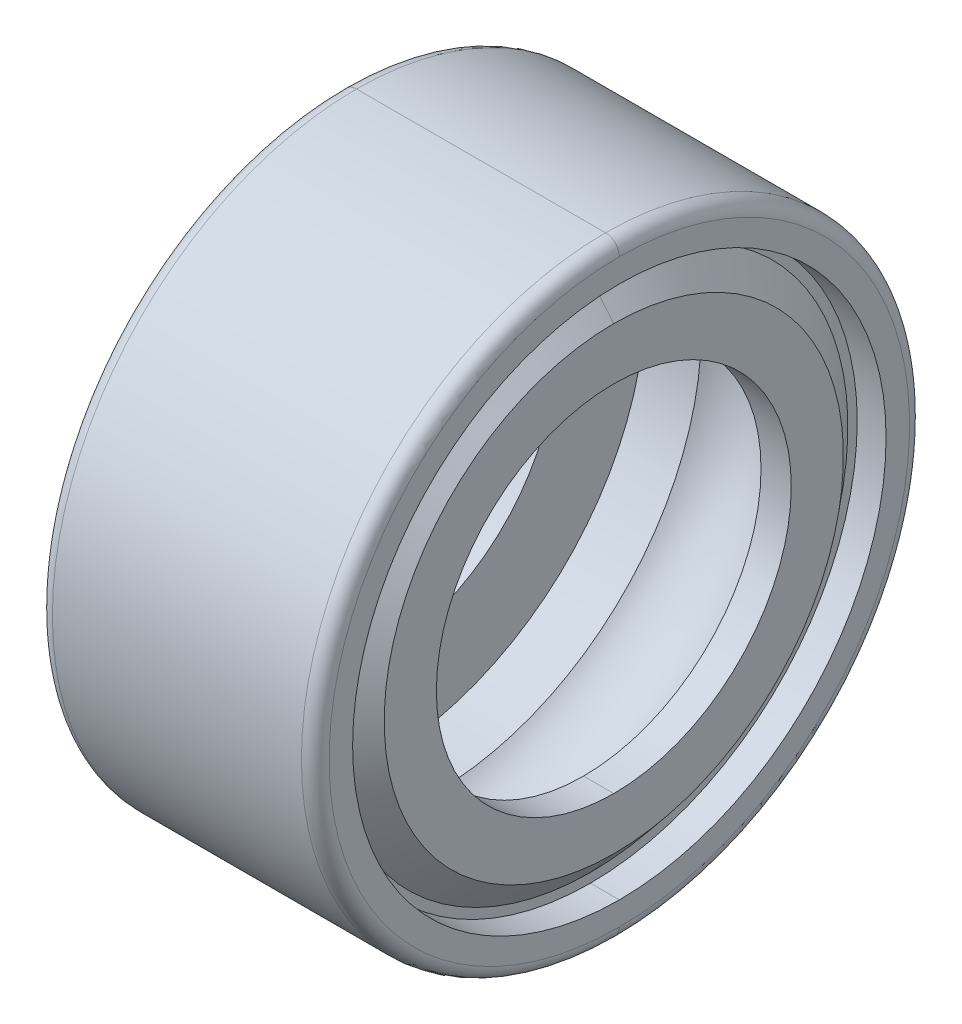
ISO-10303-21;
HEADER;
FILE_DESCRIPTION(('STEP AP214'),'2;1');
FILE_NAME('part.step','',(''),(''),'','','');
FILE_SCHEMA(('AUTOMOTIVE_DESIGN { 1 0 10303 214 1 1 1 1 }'));
ENDSEC;
DATA;
#1=APPLICATION_CONTEXT('core data for automotive mechanical design processes');
#2=APPLICATION_PROTOCOL_DEFINITION('international standard','automotive_design',2000,#1);
#3=PRODUCT_CONTEXT('',#1,'mechanical');
#4=PRODUCT('Part','Part','',(#3));
#5=PRODUCT_RELATED_PRODUCT_CATEGORY('part','',(#4));
#6=PRODUCT_DEFINITION_FORMATION('','',#4);
#7=PRODUCT_DEFINITION_CONTEXT('part definition',#1,'design');
#8=PRODUCT_DEFINITION('design','',#6,#7);
#9=PRODUCT_DEFINITION_SHAPE('','',#8);
#10=(LENGTH_UNIT() NAMED_UNIT(*) SI_UNIT(.MILLI.,.METRE.));
#11=(NAMED_UNIT(*) PLANE_ANGLE_UNIT() SI_UNIT($,.RADIAN.));
#12=(NAMED_UNIT(*) SI_UNIT($,.STERADIAN.) SOLID_ANGLE_UNIT());
#13=UNCERTAINTY_MEASURE_WITH_UNIT(LENGTH_MEASURE(1.E-05),#10,'distance_accuracy_value','');
#14=(GEOMETRIC_REPRESENTATION_CONTEXT(3) GLOBAL_UNCERTAINTY_ASSIGNED_CONTEXT((#13)) GLOBAL_UNIT_ASSIGNED_CONTEXT((#10,
#11,#12)) REPRESENTATION_CONTEXT('',''));
#15=CARTESIAN_POINT('',(0.,0.,0.));
#16=DIRECTION('',(0.,0.,1.));
#17=DIRECTION('',(1.,0.,0.));
#18=AXIS2_PLACEMENT_3D('',#15,#16,#17);
#19=CARTESIAN_POINT('',(-1.97999333714655,0.,0.));
#20=DIRECTION('',(1.,0.,0.));
#21=DIRECTION('',(0.,1.,0.));
#22=AXIS2_PLACEMENT_3D('',#19,#20,#21);
#23=PLANE('',#22);
#24=CARTESIAN_POINT('',(-1.97999333714655,0.,0.));
#25=DIRECTION('',(-1.,0.,0.));
#26=DIRECTION('',(0.,1.,0.));
#27=AXIS2_PLACEMENT_3D('',#24,#25,#26);
#28=CIRCLE('',#27,4.6547982215);
#29=CARTESIAN_POINT('',(-1.97999333714655,4.6547982215,0.));
#30=VERTEX_POINT('',#29);
#31=CARTESIAN_POINT('',(-1.97999333714655,-4.6547982215,0.));
#32=VERTEX_POINT('',#31);
#33=EDGE_CURVE('E304',#30,#32,#28,.T.);
#34=ORIENTED_EDGE('',*,*,#33,.F.);
#35=CARTESIAN_POINT('',(-1.97999333714655,0.,0.));
#36=DIRECTION('',(1.,0.,0.));
#37=DIRECTION('',(0.,1.,0.));
#38=AXIS2_PLACEMENT_3D('',#35,#36,#37);
#39=CIRCLE('',#38,4.6547982215);
#40=EDGE_CURVE('E338',#30,#32,#39,.T.);
#41=ORIENTED_EDGE('',*,*,#40,.T.);
#42=EDGE_LOOP('',(#34,#41));
#43=FACE_BOUND('',#42,.T.);
#44=CARTESIAN_POINT('',(-1.97999333714655,0.,0.));
#45=DIRECTION('',(1.,0.,0.));
#46=DIRECTION('',(0.,-1.,0.));
#47=AXIS2_PLACEMENT_3D('',#44,#45,#46);
#48=CIRCLE('',#47,4.8236251);
#49=CARTESIAN_POINT('',(-1.97999333714655,-4.8236251,0.));
#50=VERTEX_POINT('',#49);
#51=CARTESIAN_POINT('',(-1.97999333714655,4.8236251,0.));
#52=VERTEX_POINT('',#51);
#53=EDGE_CURVE('E27',#50,#52,#48,.T.);
#54=ORIENTED_EDGE('',*,*,#53,.F.);
#55=CARTESIAN_POINT('',(-1.97999333714655,0.,0.));
#56=DIRECTION('',(1.,0.,0.));
#57=DIRECTION('',(0.,1.,0.));
#58=AXIS2_PLACEMENT_3D('',#55,#56,#57);
#59=CIRCLE('',#58,4.8236251);
#60=EDGE_CURVE('E11',#52,#50,#59,.T.);
#61=ORIENTED_EDGE('',*,*,#60,.F.);
#62=EDGE_LOOP('',(#54,#61));
#63=FACE_BOUND('',#62,.T.);
#64=ADVANCED_FACE('F16',(#43,#63),#23,.F.);
#65=CARTESIAN_POINT('',(-2.75209,0.,0.));
#66=DIRECTION('',(1.,0.,0.));
#67=DIRECTION('',(0.,-1.,0.));
#68=AXIS2_PLACEMENT_3D('',#65,#66,#67);
#69=CYLINDRICAL_SURFACE('',#68,4.8236251);
#70=DIRECTION('',(1.,0.,0.));
#71=VECTOR('',#70,1.);
#72=CARTESIAN_POINT('',(-2.5019,-4.8236251,0.));
#73=LINE('',#72,#71);
#74=CARTESIAN_POINT('',(-2.5019,-4.8236251,0.));
#75=VERTEX_POINT('',#74);
#76=EDGE_CURVE('E333',#75,#50,#73,.T.);
#77=ORIENTED_EDGE('',*,*,#76,.F.);
#78=CARTESIAN_POINT('',(-2.5019,0.,0.));
#79=DIRECTION('',(1.,0.,0.));
#80=DIRECTION('',(0.,1.,0.));
#81=AXIS2_PLACEMENT_3D('',#78,#79,#80);
#82=CIRCLE('',#81,4.8236251);
#83=CARTESIAN_POINT('',(-2.5019,4.8236251,0.));
#84=VERTEX_POINT('',#83);
#85=EDGE_CURVE('E334',#84,#75,#82,.T.);
#86=ORIENTED_EDGE('',*,*,#85,.F.);
#87=DIRECTION('',(1.,0.,0.));
#88=VECTOR('',#87,1.);
#89=CARTESIAN_POINT('',(-2.5019,4.8236251,0.));
#90=LINE('',#89,#88);
#91=EDGE_CURVE('E330',#84,#52,#90,.T.);
#92=ORIENTED_EDGE('',*,*,#91,.T.);
#93=ORIENTED_EDGE('',*,*,#60,.T.);
#94=EDGE_LOOP('',(#77,#86,#92,#93));
#95=FACE_BOUND('',#94,.T.);
#96=ADVANCED_FACE('F493',(#95),#69,.F.);
#97=CARTESIAN_POINT('',(-2.75209,0.,0.));
#98=DIRECTION('',(1.,0.,0.));
#99=DIRECTION('',(0.,-1.,0.));
#100=AXIS2_PLACEMENT_3D('',#97,#98,#99);
#101=CYLINDRICAL_SURFACE('',#100,4.8236251);
#102=ORIENTED_EDGE('',*,*,#91,.F.);
#103=CARTESIAN_POINT('',(-2.5019,0.,0.));
#104=DIRECTION('',(-1.,0.,0.));
#105=DIRECTION('',(0.,1.,0.));
#106=AXIS2_PLACEMENT_3D('',#103,#104,#105);
#107=CIRCLE('',#106,4.8236251);
#108=EDGE_CURVE('E367',#84,#75,#107,.T.);
#109=ORIENTED_EDGE('',*,*,#108,.T.);
#110=ORIENTED_EDGE('',*,*,#76,.T.);
#111=ORIENTED_EDGE('',*,*,#53,.T.);
#112=EDGE_LOOP('',(#102,#109,#110,#111));
#113=FACE_BOUND('',#112,.T.);
#114=ADVANCED_FACE('F499',(#113),#101,.F.);
#115=CARTESIAN_POINT('',(-2.5019,0.,0.));
#116=DIRECTION('',(1.,0.,0.));
#117=DIRECTION('',(0.,1.,0.));
#118=AXIS2_PLACEMENT_3D('',#115,#116,#117);
#119=PLANE('',#118);
#120=ORIENTED_EDGE('',*,*,#108,.F.);
#121=ORIENTED_EDGE('',*,*,#85,.T.);
#122=EDGE_LOOP('',(#120,#121));
#123=FACE_BOUND('',#122,.T.);
#124=CARTESIAN_POINT('',(-2.5019,0.,0.));
#125=DIRECTION('',(1.,0.,0.));
#126=DIRECTION('',(0.,1.,0.));
#127=AXIS2_PLACEMENT_3D('',#124,#125,#126);
#128=CIRCLE('',#127,5.24891);
#129=CARTESIAN_POINT('',(-2.5019,5.24891,0.));
#130=VERTEX_POINT('',#129);
#131=CARTESIAN_POINT('',(-2.5019,-5.24891,0.));
#132=VERTEX_POINT('',#131);
#133=EDGE_CURVE('E291',#130,#132,#128,.T.);
#134=ORIENTED_EDGE('',*,*,#133,.F.);
#135=CARTESIAN_POINT('',(-2.5019,0.,0.));
#136=DIRECTION('',(-1.,0.,0.));
#137=DIRECTION('',(0.,1.,0.));
#138=AXIS2_PLACEMENT_3D('',#135,#136,#137);
#139=CIRCLE('',#138,5.24891);
#140=EDGE_CURVE('E326',#130,#132,#139,.T.);
#141=ORIENTED_EDGE('',*,*,#140,.T.);
#142=EDGE_LOOP('',(#134,#141));
#143=FACE_BOUND('',#142,.T.);
#144=ADVANCED_FACE('F488',(#123,#143),#119,.F.);
#145=CARTESIAN_POINT('',(-2.25171,0.,0.));
#146=DIRECTION('',(1.,0.,0.));
#147=DIRECTION('',(0.,-1.,0.));
#148=AXIS2_PLACEMENT_3D('',#145,#146,#147);
#149=TOROIDAL_SURFACE('',#148,5.24891,0.25019);
#150=CARTESIAN_POINT('',(-2.25171,0.,0.));
#151=DIRECTION('',(-1.,0.,0.));
#152=DIRECTION('',(0.,1.,0.));
#153=AXIS2_PLACEMENT_3D('',#150,#151,#152);
#154=CIRCLE('',#153,5.4991);
#155=CARTESIAN_POINT('',(-2.25171,5.4991,0.));
#156=VERTEX_POINT('',#155);
#157=CARTESIAN_POINT('',(-2.25171,-5.4991,0.));
#158=VERTEX_POINT('',#157);
#159=EDGE_CURVE('E318',#156,#158,#154,.T.);
#160=ORIENTED_EDGE('',*,*,#159,.T.);
#161=CARTESIAN_POINT('',(-2.25171,-5.24891,0.));
#162=DIRECTION('',(0.,0.,-1.));
#163=DIRECTION('',(0.,-1.,0.));
#164=AXIS2_PLACEMENT_3D('',#161,#162,#163);
#165=CIRCLE('',#164,0.25019);
#166=EDGE_CURVE('E191',#158,#132,#165,.T.);
#167=ORIENTED_EDGE('',*,*,#166,.T.);
#168=ORIENTED_EDGE('',*,*,#140,.F.);
#169=CARTESIAN_POINT('',(-2.25171,5.24891,0.));
#170=DIRECTION('',(0.,0.,1.));
#171=DIRECTION('',(0.,1.,0.));
#172=AXIS2_PLACEMENT_3D('',#169,#170,#171);
#173=CIRCLE('',#172,0.25019);
#174=EDGE_CURVE('E290',#156,#130,#173,.T.);
#175=ORIENTED_EDGE('',*,*,#174,.F.);
#176=EDGE_LOOP('',(#160,#167,#168,#175));
#177=FACE_BOUND('',#176,.T.);
#178=ADVANCED_FACE('F477',(#177),#149,.T.);
#179=CARTESIAN_POINT('',(-2.25171,0.,0.));
#180=DIRECTION('',(1.,0.,0.));
#181=DIRECTION('',(0.,-1.,0.));
#182=AXIS2_PLACEMENT_3D('',#179,#180,#181);
#183=TOROIDAL_SURFACE('',#182,5.24891,0.25019);
#184=ORIENTED_EDGE('',*,*,#133,.T.);
#185=ORIENTED_EDGE('',*,*,#166,.F.);
#186=CARTESIAN_POINT('',(-2.25171,0.,0.));
#187=DIRECTION('',(1.,0.,0.));
#188=DIRECTION('',(0.,1.,0.));
#189=AXIS2_PLACEMENT_3D('',#186,#187,#188);
#190=CIRCLE('',#189,5.4991);
#191=EDGE_CURVE('E349',#156,#158,#190,.T.);
#192=ORIENTED_EDGE('',*,*,#191,.F.);
#193=ORIENTED_EDGE('',*,*,#174,.T.);
#194=EDGE_LOOP('',(#184,#185,#192,#193));
#195=FACE_BOUND('',#194,.T.);
#196=ADVANCED_FACE('F479',(#195),#183,.T.);
#197=CARTESIAN_POINT('',(-2.75209,0.,0.));
#198=DIRECTION('',(1.,0.,0.));
#199=DIRECTION('',(0.,-1.,0.));
#200=AXIS2_PLACEMENT_3D('',#197,#198,#199);
#201=CYLINDRICAL_SURFACE('',#200,5.4991);
#202=ORIENTED_EDGE('',*,*,#191,.T.);
#203=DIRECTION('',(-1.,0.,0.));
#204=VECTOR('',#203,1.);
#205=CARTESIAN_POINT('',(2.25171,-5.4991,0.));
#206=LINE('',#205,#204);
#207=CARTESIAN_POINT('',(2.25171,-5.4991,0.));
#208=VERTEX_POINT('',#207);
#209=EDGE_CURVE('E202',#208,#158,#206,.T.);
#210=ORIENTED_EDGE('',*,*,#209,.F.);
#211=CARTESIAN_POINT('',(2.25171,0.,0.));
#212=DIRECTION('',(1.,0.,0.));
#213=DIRECTION('',(0.,1.,0.));
#214=AXIS2_PLACEMENT_3D('',#211,#212,#213);
#215=CIRCLE('',#214,5.4991);
#216=CARTESIAN_POINT('',(2.25171,5.4991,0.));
#217=VERTEX_POINT('',#216);
#218=EDGE_CURVE('E348',#217,#208,#215,.T.);
#219=ORIENTED_EDGE('',*,*,#218,.F.);
#220=DIRECTION('',(-1.,0.,0.));
#221=VECTOR('',#220,1.);
#222=CARTESIAN_POINT('',(2.25171,5.4991,0.));
#223=LINE('',#222,#221);
#224=EDGE_CURVE('E321',#217,#156,#223,.T.);
#225=ORIENTED_EDGE('',*,*,#224,.T.);
#226=EDGE_LOOP('',(#202,#210,#219,#225));
#227=FACE_BOUND('',#226,.T.);
#228=ADVANCED_FACE('F474',(#227),#201,.T.);
#229=CARTESIAN_POINT('',(-2.75209,0.,0.));
#230=DIRECTION('',(1.,0.,0.));
#231=DIRECTION('',(0.,-1.,0.));
#232=AXIS2_PLACEMENT_3D('',#229,#230,#231);
#233=CYLINDRICAL_SURFACE('',#232,5.4991);
#234=CARTESIAN_POINT('',(2.25171,0.,0.));
#235=DIRECTION('',(-1.,0.,0.));
#236=DIRECTION('',(0.,1.,0.));
#237=AXIS2_PLACEMENT_3D('',#234,#235,#236);
#238=CIRCLE('',#237,5.4991);
#239=EDGE_CURVE('E380',#217,#208,#238,.T.);
#240=ORIENTED_EDGE('',*,*,#239,.T.);
#241=ORIENTED_EDGE('',*,*,#209,.T.);
#242=ORIENTED_EDGE('',*,*,#159,.F.);
#243=ORIENTED_EDGE('',*,*,#224,.F.);
#244=EDGE_LOOP('',(#240,#241,#242,#243));
#245=FACE_BOUND('',#244,.T.);
#246=ADVANCED_FACE('F465',(#245),#233,.T.);
#247=CARTESIAN_POINT('',(2.25171,0.,0.));
#248=DIRECTION('',(1.,0.,0.));
#249=DIRECTION('',(0.,-1.,0.));
#250=AXIS2_PLACEMENT_3D('',#247,#248,#249);
#251=TOROIDAL_SURFACE('',#250,5.24891,0.25019);
#252=CARTESIAN_POINT('',(2.5019,0.,0.));
#253=DIRECTION('',(-1.,0.,0.));
#254=DIRECTION('',(0.,1.,0.));
#255=AXIS2_PLACEMENT_3D('',#252,#253,#254);
#256=CIRCLE('',#255,5.24891);
#257=CARTESIAN_POINT('',(2.5019,5.24891,0.));
#258=VERTEX_POINT('',#257);
#259=CARTESIAN_POINT('',(2.5019,-5.24891,0.));
#260=VERTEX_POINT('',#259);
#261=EDGE_CURVE('E359',#258,#260,#256,.T.);
#262=ORIENTED_EDGE('',*,*,#261,.T.);
#263=CARTESIAN_POINT('',(2.25171,-5.24891,0.));
#264=DIRECTION('',(0.,0.,-1.));
#265=DIRECTION('',(1.,0.,0.));
#266=AXIS2_PLACEMENT_3D('',#263,#264,#265);
#267=CIRCLE('',#266,0.25019);
#268=EDGE_CURVE('E343',#260,#208,#267,.T.);
#269=ORIENTED_EDGE('',*,*,#268,.T.);
#270=ORIENTED_EDGE('',*,*,#239,.F.);
#271=CARTESIAN_POINT('',(2.25171,5.24891,0.));
#272=DIRECTION('',(0.,0.,1.));
#273=DIRECTION('',(1.,0.,0.));
#274=AXIS2_PLACEMENT_3D('',#271,#272,#273);
#275=CIRCLE('',#274,0.25019);
#276=EDGE_CURVE('E347',#258,#217,#275,.T.);
#277=ORIENTED_EDGE('',*,*,#276,.F.);
#278=EDGE_LOOP('',(#262,#269,#270,#277));
#279=FACE_BOUND('',#278,.T.);
#280=ADVANCED_FACE('F469',(#279),#251,.T.);
#281=CARTESIAN_POINT('',(2.25171,0.,0.));
#282=DIRECTION('',(1.,0.,0.));
#283=DIRECTION('',(0.,-1.,0.));
#284=AXIS2_PLACEMENT_3D('',#281,#282,#283);
#285=TOROIDAL_SURFACE('',#284,5.24891,0.25019);
#286=ORIENTED_EDGE('',*,*,#218,.T.);
#287=ORIENTED_EDGE('',*,*,#268,.F.);
#288=CARTESIAN_POINT('',(2.5019,0.,0.));
#289=DIRECTION('',(1.,0.,0.));
#290=DIRECTION('',(0.,1.,0.));
#291=AXIS2_PLACEMENT_3D('',#288,#289,#290);
#292=CIRCLE('',#291,5.24891);
#293=EDGE_CURVE('E387',#258,#260,#292,.T.);
#294=ORIENTED_EDGE('',*,*,#293,.F.);
#295=ORIENTED_EDGE('',*,*,#276,.T.);
#296=EDGE_LOOP('',(#286,#287,#294,#295));
#297=FACE_BOUND('',#296,.T.);
#298=ADVANCED_FACE('F473',(#297),#285,.T.);
#299=CARTESIAN_POINT('',(2.5019,0.,0.));
#300=DIRECTION('',(1.,0.,0.));
#301=DIRECTION('',(0.,1.,0.));
#302=AXIS2_PLACEMENT_3D('',#299,#300,#301);
#303=PLANE('',#302);
#304=CARTESIAN_POINT('',(2.5019,0.,0.));
#305=DIRECTION('',(1.,0.,0.));
#306=DIRECTION('',(0.,1.,0.));
#307=AXIS2_PLACEMENT_3D('',#304,#305,#306);
#308=CIRCLE('',#307,4.8236251);
#309=CARTESIAN_POINT('',(2.5019,4.8236251,0.));
#310=VERTEX_POINT('',#309);
#311=CARTESIAN_POINT('',(2.5019,-4.8236251,0.));
#312=VERTEX_POINT('',#311);
#313=EDGE_CURVE('E277',#310,#312,#308,.T.);
#314=ORIENTED_EDGE('',*,*,#313,.F.);
#315=CARTESIAN_POINT('',(2.5019,0.,0.));
#316=DIRECTION('',(-1.,0.,0.));
#317=DIRECTION('',(0.,1.,0.));
#318=AXIS2_PLACEMENT_3D('',#315,#316,#317);
#319=CIRCLE('',#318,4.8236251);
#320=EDGE_CURVE('E355',#310,#312,#319,.T.);
#321=ORIENTED_EDGE('',*,*,#320,.T.);
#322=EDGE_LOOP('',(#314,#321));
#323=FACE_BOUND('',#322,.T.);
#324=ORIENTED_EDGE('',*,*,#261,.F.);
#325=ORIENTED_EDGE('',*,*,#293,.T.);
#326=EDGE_LOOP('',(#324,#325));
#327=FACE_BOUND('',#326,.T.);
#328=ADVANCED_FACE('F525',(#323,#327),#303,.T.);
#329=CARTESIAN_POINT('',(-2.75209,0.,0.));
#330=DIRECTION('',(1.,0.,0.));
#331=DIRECTION('',(0.,-1.,0.));
#332=AXIS2_PLACEMENT_3D('',#329,#330,#331);
#333=CYLINDRICAL_SURFACE('',#332,4.8236251);
#334=DIRECTION('',(1.,0.,0.));
#335=VECTOR('',#334,1.);
#336=CARTESIAN_POINT('',(1.97999333714655,-4.8236251,0.));
#337=LINE('',#336,#335);
#338=CARTESIAN_POINT('',(1.97999333714655,-4.8236251,0.));
#339=VERTEX_POINT('',#338);
#340=EDGE_CURVE('E281',#339,#312,#337,.T.);
#341=ORIENTED_EDGE('',*,*,#340,.T.);
#342=ORIENTED_EDGE('',*,*,#320,.F.);
#343=DIRECTION('',(1.,0.,0.));
#344=VECTOR('',#343,1.);
#345=CARTESIAN_POINT('',(1.97999333714655,4.8236251,0.));
#346=LINE('',#345,#344);
#347=CARTESIAN_POINT('',(1.97999333714655,4.8236251,0.));
#348=VERTEX_POINT('',#347);
#349=EDGE_CURVE('E282',#348,#310,#346,.T.);
#350=ORIENTED_EDGE('',*,*,#349,.F.);
#351=CARTESIAN_POINT('',(1.97999333714655,0.,0.));
#352=DIRECTION('',(1.,0.,0.));
#353=DIRECTION('',(0.,-1.,0.));
#354=AXIS2_PLACEMENT_3D('',#351,#352,#353);
#355=CIRCLE('',#354,4.8236251);
#356=EDGE_CURVE('E360',#339,#348,#355,.T.);
#357=ORIENTED_EDGE('',*,*,#356,.F.);
#358=EDGE_LOOP('',(#341,#342,#350,#357));
#359=FACE_BOUND('',#358,.T.);
#360=ADVANCED_FACE('F504',(#359),#333,.F.);
#361=CARTESIAN_POINT('',(1.97999333714655,0.,0.));
#362=DIRECTION('',(1.,0.,0.));
#363=DIRECTION('',(0.,1.,0.));
#364=AXIS2_PLACEMENT_3D('',#361,#362,#363);
#365=PLANE('',#364);
#366=CARTESIAN_POINT('',(1.97999333714655,0.,0.));
#367=DIRECTION('',(1.,0.,0.));
#368=DIRECTION('',(0.,1.,0.));
#369=AXIS2_PLACEMENT_3D('',#366,#367,#368);
#370=CIRCLE('',#369,4.6547982215);
#371=CARTESIAN_POINT('',(1.97999333714655,4.6547982215,0.));
#372=VERTEX_POINT('',#371);
#373=CARTESIAN_POINT('',(1.97999333714655,-4.6547982215,0.));
#374=VERTEX_POINT('',#373);
#375=EDGE_CURVE('E267',#372,#374,#370,.T.);
#376=ORIENTED_EDGE('',*,*,#375,.F.);
#377=CARTESIAN_POINT('',(1.97999333714655,0.,0.));
#378=DIRECTION('',(-1.,0.,0.));
#379=DIRECTION('',(0.,1.,0.));
#380=AXIS2_PLACEMENT_3D('',#377,#378,#379);
#381=CIRCLE('',#380,4.6547982215);
#382=EDGE_CURVE('E315',#372,#374,#381,.T.);
#383=ORIENTED_EDGE('',*,*,#382,.T.);
#384=EDGE_LOOP('',(#376,#383));
#385=FACE_BOUND('',#384,.T.);
#386=ORIENTED_EDGE('',*,*,#356,.T.);
#387=CARTESIAN_POINT('',(1.97999333714655,0.,0.));
#388=DIRECTION('',(1.,0.,0.));
#389=DIRECTION('',(0.,1.,0.));
#390=AXIS2_PLACEMENT_3D('',#387,#388,#389);
#391=CIRCLE('',#390,4.8236251);
#392=EDGE_CURVE('E413',#348,#339,#391,.T.);
#393=ORIENTED_EDGE('',*,*,#392,.T.);
#394=EDGE_LOOP('',(#386,#393));
#395=FACE_BOUND('',#394,.T.);
#396=ADVANCED_FACE('F534',(#385,#395),#365,.T.);
#397=CARTESIAN_POINT('',(-2.75209,0.,0.));
#398=DIRECTION('',(1.,0.,0.));
#399=DIRECTION('',(0.,-1.,0.));
#400=AXIS2_PLACEMENT_3D('',#397,#398,#399);
#401=CYLINDRICAL_SURFACE('',#400,4.8236251);
#402=ORIENTED_EDGE('',*,*,#349,.T.);
#403=ORIENTED_EDGE('',*,*,#313,.T.);
#404=ORIENTED_EDGE('',*,*,#340,.F.);
#405=ORIENTED_EDGE('',*,*,#392,.F.);
#406=EDGE_LOOP('',(#402,#403,#404,#405));
#407=FACE_BOUND('',#406,.T.);
#408=ADVANCED_FACE('F510',(#407),#401,.F.);
#409=CARTESIAN_POINT('',(2.41442691132523,0.,0.));
#410=DIRECTION('',(-1.,0.,0.));
#411=DIRECTION('',(0.,1.,0.));
#412=AXIS2_PLACEMENT_3D('',#409,#410,#411);
#413=CONICAL_SURFACE('',#412,4.13706044872901,0.872664625997165);
#414=CARTESIAN_POINT('',(2.401824,0.,0.));
#415=DIRECTION('',(-1.,0.,0.));
#416=DIRECTION('',(0.,1.,0.));
#417=AXIS2_PLACEMENT_3D('',#414,#415,#416);
#418=CIRCLE('',#417,4.152080013578);
#419=CARTESIAN_POINT('',(2.401824,4.152080013578,0.));
#420=VERTEX_POINT('',#419);
#421=CARTESIAN_POINT('',(2.401824,-4.152080013578,0.));
#422=VERTEX_POINT('',#421);
#423=EDGE_CURVE('E229',#420,#422,#418,.T.);
#424=ORIENTED_EDGE('',*,*,#423,.T.);
#425=DIRECTION('',(-0.642787609686539,-0.766044443118978,0.));
#426=VECTOR('',#425,1.);
#427=CARTESIAN_POINT('',(2.401824,-4.152080013578,0.));
#428=LINE('',#427,#426);
#429=EDGE_CURVE('E272',#422,#374,#428,.T.);
#430=ORIENTED_EDGE('',*,*,#429,.T.);
#431=ORIENTED_EDGE('',*,*,#382,.F.);
#432=DIRECTION('',(-0.642787609686539,0.766044443118978,0.));
#433=VECTOR('',#432,1.);
#434=CARTESIAN_POINT('',(2.401824,4.152080013578,0.));
#435=LINE('',#434,#433);
#436=EDGE_CURVE('E276',#420,#372,#435,.T.);
#437=ORIENTED_EDGE('',*,*,#436,.F.);
#438=EDGE_LOOP('',(#424,#430,#431,#437));
#439=FACE_BOUND('',#438,.T.);
#440=ADVANCED_FACE('F506',(#439),#413,.T.);
#441=CARTESIAN_POINT('',(2.41442691132523,0.,0.));
#442=DIRECTION('',(-1.,0.,0.));
#443=DIRECTION('',(0.,1.,0.));
#444=AXIS2_PLACEMENT_3D('',#441,#442,#443);
#445=CONICAL_SURFACE('',#444,4.13706044872901,0.872664625997165);
#446=ORIENTED_EDGE('',*,*,#375,.T.);
#447=ORIENTED_EDGE('',*,*,#429,.F.);
#448=CARTESIAN_POINT('',(2.401824,0.,0.));
#449=DIRECTION('',(1.,0.,0.));
#450=DIRECTION('',(0.,1.,0.));
#451=AXIS2_PLACEMENT_3D('',#448,#449,#450);
#452=CIRCLE('',#451,4.152080013578);
#453=EDGE_CURVE('E258',#420,#422,#452,.T.);
#454=ORIENTED_EDGE('',*,*,#453,.F.);
#455=ORIENTED_EDGE('',*,*,#436,.T.);
#456=EDGE_LOOP('',(#446,#447,#454,#455));
#457=FACE_BOUND('',#456,.T.);
#458=ADVANCED_FACE('F509',(#457),#445,.T.);
#459=CARTESIAN_POINT('',(2.401824,0.,0.));
#460=DIRECTION('',(1.,0.,0.));
#461=DIRECTION('',(0.,1.,0.));
#462=AXIS2_PLACEMENT_3D('',#459,#460,#461);
#463=PLANE('',#462);
#464=CARTESIAN_POINT('',(2.401824,0.,0.));
#465=DIRECTION('',(1.,0.,0.));
#466=DIRECTION('',(0.,1.,0.));
#467=AXIS2_PLACEMENT_3D('',#464,#465,#466);
#468=CIRCLE('',#467,3.209148649);
#469=CARTESIAN_POINT('',(2.401824,3.209148649,0.));
#470=VERTEX_POINT('',#469);
#471=CARTESIAN_POINT('',(2.401824,-3.209148649,0.));
#472=VERTEX_POINT('',#471);
#473=EDGE_CURVE('E233',#470,#472,#468,.T.);
#474=ORIENTED_EDGE('',*,*,#473,.F.);
#475=CARTESIAN_POINT('',(2.401824,0.,0.));
#476=DIRECTION('',(-1.,0.,0.));
#477=DIRECTION('',(0.,1.,0.));
#478=AXIS2_PLACEMENT_3D('',#475,#476,#477);
#479=CIRCLE('',#478,3.209148649);
#480=EDGE_CURVE('E218',#470,#472,#479,.T.);
#481=ORIENTED_EDGE('',*,*,#480,.T.);
#482=EDGE_LOOP('',(#474,#481));
#483=FACE_BOUND('',#482,.T.);
#484=ORIENTED_EDGE('',*,*,#423,.F.);
#485=ORIENTED_EDGE('',*,*,#453,.T.);
#486=EDGE_LOOP('',(#484,#485));
#487=FACE_BOUND('',#486,.T.);
#488=ADVANCED_FACE('F239',(#483,#487),#463,.T.);
#489=CARTESIAN_POINT('',(-2.6420064,0.,0.));
#490=DIRECTION('',(1.,0.,0.));
#491=DIRECTION('',(0.,-1.,0.));
#492=AXIS2_PLACEMENT_3D('',#489,#490,#491);
#493=CYLINDRICAL_SURFACE('',#492,3.209148649);
#494=CARTESIAN_POINT('',(1.85489833714655,0.,0.));
#495=DIRECTION('',(-1.,0.,0.));
#496=DIRECTION('',(0.,1.,0.));
#497=AXIS2_PLACEMENT_3D('',#494,#495,#496);
#498=CIRCLE('',#497,3.209148649);
#499=CARTESIAN_POINT('',(1.85489833714655,3.209148649,0.));
#500=VERTEX_POINT('',#499);
#501=CARTESIAN_POINT('',(1.85489833714655,-3.209148649,0.));
#502=VERTEX_POINT('',#501);
#503=EDGE_CURVE('E249',#500,#502,#498,.T.);
#504=ORIENTED_EDGE('',*,*,#503,.T.);
#505=DIRECTION('',(1.,0.,0.));
#506=VECTOR('',#505,1.);
#507=CARTESIAN_POINT('',(1.85489833714655,-3.209148649,0.));
#508=LINE('',#507,#506);
#509=EDGE_CURVE('E224',#502,#472,#508,.T.);
#510=ORIENTED_EDGE('',*,*,#509,.T.);
#511=ORIENTED_EDGE('',*,*,#480,.F.);
#512=DIRECTION('',(1.,0.,0.));
#513=VECTOR('',#512,1.);
#514=CARTESIAN_POINT('',(1.85489833714655,3.209148649,0.));
#515=LINE('',#514,#513);
#516=EDGE_CURVE('E222',#500,#470,#515,.T.);
#517=ORIENTED_EDGE('',*,*,#516,.F.);
#518=EDGE_LOOP('',(#504,#510,#511,#517));
#519=FACE_BOUND('',#518,.T.);
#520=ADVANCED_FACE('F221',(#519),#493,.F.);
#521=CARTESIAN_POINT('',(-2.6420064,0.,0.));
#522=DIRECTION('',(1.,0.,0.));
#523=DIRECTION('',(0.,-1.,0.));
#524=AXIS2_PLACEMENT_3D('',#521,#522,#523);
#525=CYLINDRICAL_SURFACE('',#524,3.209148649);
#526=ORIENTED_EDGE('',*,*,#473,.T.);
#527=ORIENTED_EDGE('',*,*,#509,.F.);
#528=CARTESIAN_POINT('',(1.85489833714655,0.,0.));
#529=DIRECTION('',(1.,0.,0.));
#530=DIRECTION('',(0.,1.,0.));
#531=AXIS2_PLACEMENT_3D('',#528,#529,#530);
#532=CIRCLE('',#531,3.209148649);
#533=EDGE_CURVE('E235',#500,#502,#532,.T.);
#534=ORIENTED_EDGE('',*,*,#533,.F.);
#535=ORIENTED_EDGE('',*,*,#516,.T.);
#536=EDGE_LOOP('',(#526,#527,#534,#535));
#537=FACE_BOUND('',#536,.T.);
#538=ADVANCED_FACE('F232',(#537),#525,.F.);
#539=CARTESIAN_POINT('',(1.85489833714655,0.,0.));
#540=DIRECTION('',(1.,0.,0.));
#541=DIRECTION('',(0.,1.,0.));
#542=AXIS2_PLACEMENT_3D('',#539,#540,#541);
#543=PLANE('',#542);
#544=ORIENTED_EDGE('',*,*,#503,.F.);
#545=ORIENTED_EDGE('',*,*,#533,.T.);
#546=EDGE_LOOP('',(#544,#545));
#547=FACE_BOUND('',#546,.T.);
#548=CARTESIAN_POINT('',(1.85489833714655,0.,0.));
#549=DIRECTION('',(1.,0.,0.));
#550=DIRECTION('',(0.,-1.,0.));
#551=AXIS2_PLACEMENT_3D('',#548,#549,#550);
#552=CIRCLE('',#551,4.8236251);
#553=CARTESIAN_POINT('',(1.85489833714655,-4.8236251,0.));
#554=VERTEX_POINT('',#553);
#555=CARTESIAN_POINT('',(1.85489833714655,4.8236251,0.));
#556=VERTEX_POINT('',#555);
#557=EDGE_CURVE('E20',#554,#556,#552,.T.);
#558=ORIENTED_EDGE('',*,*,#557,.F.);
#559=CARTESIAN_POINT('',(1.85489833714655,0.,0.));
#560=DIRECTION('',(1.,0.,0.));
#561=DIRECTION('',(0.,1.,0.));
#562=AXIS2_PLACEMENT_3D('',#559,#560,#561);
#563=CIRCLE('',#562,4.8236251);
#564=EDGE_CURVE('E268',#556,#554,#563,.T.);
#565=ORIENTED_EDGE('',*,*,#564,.F.);
#566=EDGE_LOOP('',(#558,#565));
#567=FACE_BOUND('',#566,.T.);
#568=ADVANCED_FACE('F512',(#547,#567),#543,.F.);
#569=CARTESIAN_POINT('',(-2.75209,0.,0.));
#570=DIRECTION('',(1.,0.,0.));
#571=DIRECTION('',(0.,-1.,0.));
#572=AXIS2_PLACEMENT_3D('',#569,#570,#571);
#573=CYLINDRICAL_SURFACE('',#572,4.8236251);
#574=DIRECTION('',(1.,0.,0.));
#575=VECTOR('',#574,1.);
#576=CARTESIAN_POINT('',(0.839755569912453,-4.8236251,0.));
#577=LINE('',#576,#575);
#578=CARTESIAN_POINT('',(0.839755569912453,-4.8236251,0.));
#579=VERTEX_POINT('',#578);
#580=EDGE_CURVE('E361',#579,#554,#577,.T.);
#581=ORIENTED_EDGE('',*,*,#580,.F.);
#582=CARTESIAN_POINT('',(0.839755569912455,0.,0.));
#583=DIRECTION('',(1.,0.,0.));
#584=DIRECTION('',(0.,1.,0.));
#585=AXIS2_PLACEMENT_3D('',#582,#583,#584);
#586=CIRCLE('',#585,4.8236251);
#587=CARTESIAN_POINT('',(0.839755569912453,4.8236251,0.));
#588=VERTEX_POINT('',#587);
#589=EDGE_CURVE('E383',#588,#579,#586,.T.);
#590=ORIENTED_EDGE('',*,*,#589,.F.);
#591=DIRECTION('',(1.,0.,0.));
#592=VECTOR('',#591,1.);
#593=CARTESIAN_POINT('',(0.839755569912453,4.8236251,0.));
#594=LINE('',#593,#592);
#595=EDGE_CURVE('E314',#588,#556,#594,.T.);
#596=ORIENTED_EDGE('',*,*,#595,.T.);
#597=ORIENTED_EDGE('',*,*,#564,.T.);
#598=EDGE_LOOP('',(#581,#590,#596,#597));
#599=FACE_BOUND('',#598,.T.);
#600=ADVANCED_FACE('F515',(#599),#573,.F.);
#601=CARTESIAN_POINT('',(-2.75209,0.,0.));
#602=DIRECTION('',(1.,0.,0.));
#603=DIRECTION('',(0.,-1.,0.));
#604=AXIS2_PLACEMENT_3D('',#601,#602,#603);
#605=CYLINDRICAL_SURFACE('',#604,4.8236251);
#606=ORIENTED_EDGE('',*,*,#595,.F.);
#607=CARTESIAN_POINT('',(0.839755569912455,0.,0.));
#608=DIRECTION('',(-1.,0.,0.));
#609=DIRECTION('',(0.,1.,0.));
#610=AXIS2_PLACEMENT_3D('',#607,#608,#609);
#611=CIRCLE('',#610,4.8236251);
#612=EDGE_CURVE('E303',#588,#579,#611,.T.);
#613=ORIENTED_EDGE('',*,*,#612,.T.);
#614=ORIENTED_EDGE('',*,*,#580,.T.);
#615=ORIENTED_EDGE('',*,*,#557,.T.);
#616=EDGE_LOOP('',(#606,#613,#614,#615));
#617=FACE_BOUND('',#616,.T.);
#618=ADVANCED_FACE('F541',(#617),#605,.F.);
#619=CARTESIAN_POINT('',(0.,0.,0.));
#620=DIRECTION('',(1.,0.,0.));
#621=DIRECTION('',(0.,-1.,0.));
#622=AXIS2_PLACEMENT_3D('',#619,#620,#621);
#623=TOROIDAL_SURFACE('',#622,4.0005,1.175893);
#624=CARTESIAN_POINT('',(-0.839755569912454,0.,0.));
#625=DIRECTION('',(-1.,0.,0.));
#626=DIRECTION('',(0.,1.,0.));
#627=AXIS2_PLACEMENT_3D('',#624,#625,#626);
#628=CIRCLE('',#627,4.8236251);
#629=CARTESIAN_POINT('',(-0.839755569912454,4.8236251,0.));
#630=VERTEX_POINT('',#629);
#631=CARTESIAN_POINT('',(-0.839755569912454,-4.8236251,0.));
#632=VERTEX_POINT('',#631);
#633=EDGE_CURVE('E297',#630,#632,#628,.T.);
#634=ORIENTED_EDGE('',*,*,#633,.T.);
#635=CARTESIAN_POINT('',(0.,-4.0005,0.));
#636=DIRECTION('',(0.,0.,1.));
#637=DIRECTION('',(-0.714142842854285,-0.7,0.));
#638=AXIS2_PLACEMENT_3D('',#635,#636,#637);
#639=CIRCLE('',#638,1.175893);
#640=EDGE_CURVE('E93',#632,#579,#639,.T.);
#641=ORIENTED_EDGE('',*,*,#640,.T.);
#642=ORIENTED_EDGE('',*,*,#612,.F.);
#643=CARTESIAN_POINT('',(0.,4.0005,0.));
#644=DIRECTION('',(0.,0.,-1.));
#645=DIRECTION('',(-0.714142842854285,0.7,0.));
#646=AXIS2_PLACEMENT_3D('',#643,#644,#645);
#647=CIRCLE('',#646,1.175893);
#648=EDGE_CURVE('E77',#630,#588,#647,.T.);
#649=ORIENTED_EDGE('',*,*,#648,.F.);
#650=EDGE_LOOP('',(#634,#641,#642,#649));
#651=FACE_BOUND('',#650,.T.);
#652=ADVANCED_FACE('F546',(#651),#623,.F.);
#653=CARTESIAN_POINT('',(0.,0.,0.));
#654=DIRECTION('',(1.,0.,0.));
#655=DIRECTION('',(0.,-1.,0.));
#656=AXIS2_PLACEMENT_3D('',#653,#654,#655);
#657=TOROIDAL_SURFACE('',#656,4.0005,1.175893);
#658=ORIENTED_EDGE('',*,*,#589,.T.);
#659=ORIENTED_EDGE('',*,*,#640,.F.);
#660=CARTESIAN_POINT('',(-0.839755569912454,0.,0.));
#661=DIRECTION('',(1.,0.,0.));
#662=DIRECTION('',(0.,1.,0.));
#663=AXIS2_PLACEMENT_3D('',#660,#661,#662);
#664=CIRCLE('',#663,4.8236251);
#665=EDGE_CURVE('E396',#630,#632,#664,.T.);
#666=ORIENTED_EDGE('',*,*,#665,.F.);
#667=ORIENTED_EDGE('',*,*,#648,.T.);
#668=EDGE_LOOP('',(#658,#659,#666,#667));
#669=FACE_BOUND('',#668,.T.);
#670=ADVANCED_FACE('F18',(#669),#657,.F.);
#671=CARTESIAN_POINT('',(-2.75209,0.,0.));
#672=DIRECTION('',(1.,0.,0.));
#673=DIRECTION('',(0.,-1.,0.));
#674=AXIS2_PLACEMENT_3D('',#671,#672,#673);
#675=CYLINDRICAL_SURFACE('',#674,4.8236251);
#676=DIRECTION('',(1.,0.,0.));
#677=VECTOR('',#676,1.);
#678=CARTESIAN_POINT('',(-1.85489833714655,4.8236251,0.));
#679=LINE('',#678,#677);
#680=CARTESIAN_POINT('',(-1.85489833714655,4.8236251,0.));
#681=VERTEX_POINT('',#680);
#682=EDGE_CURVE('E300',#681,#630,#679,.T.);
#683=ORIENTED_EDGE('',*,*,#682,.T.);
#684=ORIENTED_EDGE('',*,*,#665,.T.);
#685=DIRECTION('',(1.,0.,0.));
#686=VECTOR('',#685,1.);
#687=CARTESIAN_POINT('',(-1.85489833714655,-4.8236251,0.));
#688=LINE('',#687,#686);
#689=CARTESIAN_POINT('',(-1.85489833714655,-4.8236251,0.));
#690=VERTEX_POINT('',#689);
#691=EDGE_CURVE('E262',#690,#632,#688,.T.);
#692=ORIENTED_EDGE('',*,*,#691,.F.);
#693=CARTESIAN_POINT('',(-1.85489833714655,0.,0.));
#694=DIRECTION('',(1.,0.,0.));
#695=DIRECTION('',(0.,1.,0.));
#696=AXIS2_PLACEMENT_3D('',#693,#694,#695);
#697=CIRCLE('',#696,4.8236251);
#698=EDGE_CURVE('E374',#681,#690,#697,.T.);
#699=ORIENTED_EDGE('',*,*,#698,.F.);
#700=EDGE_LOOP('',(#683,#684,#692,#699));
#701=FACE_BOUND('',#700,.T.);
#702=ADVANCED_FACE('F556',(#701),#675,.F.);
#703=CARTESIAN_POINT('',(-1.85489833714655,0.,0.));
#704=DIRECTION('',(1.,0.,0.));
#705=DIRECTION('',(0.,1.,0.));
#706=AXIS2_PLACEMENT_3D('',#703,#704,#705);
#707=PLANE('',#706);
#708=CARTESIAN_POINT('',(-1.85489833714655,0.,0.));
#709=DIRECTION('',(1.,0.,0.));
#710=DIRECTION('',(0.,1.,0.));
#711=AXIS2_PLACEMENT_3D('',#708,#709,#710);
#712=CIRCLE('',#711,3.209148649);
#713=CARTESIAN_POINT('',(-1.85489833714655,3.209148649,0.));
#714=VERTEX_POINT('',#713);
#715=CARTESIAN_POINT('',(-1.85489833714655,-3.209148649,0.));
#716=VERTEX_POINT('',#715);
#717=EDGE_CURVE('E287',#714,#716,#712,.T.);
#718=ORIENTED_EDGE('',*,*,#717,.F.);
#719=CARTESIAN_POINT('',(-1.85489833714655,0.,0.));
#720=DIRECTION('',(-1.,0.,0.));
#721=DIRECTION('',(0.,1.,0.));
#722=AXIS2_PLACEMENT_3D('',#719,#720,#721);
#723=CIRCLE('',#722,3.209148649);
#724=EDGE_CURVE('E259',#714,#716,#723,.T.);
#725=ORIENTED_EDGE('',*,*,#724,.T.);
#726=EDGE_LOOP('',(#718,#725));
#727=FACE_BOUND('',#726,.T.);
#728=CARTESIAN_POINT('',(-1.85489833714655,0.,0.));
#729=DIRECTION('',(1.,0.,0.));
#730=DIRECTION('',(0.,-1.,0.));
#731=AXIS2_PLACEMENT_3D('',#728,#729,#730);
#732=CIRCLE('',#731,4.8236251);
#733=EDGE_CURVE('E342',#690,#681,#732,.T.);
#734=ORIENTED_EDGE('',*,*,#733,.T.);
#735=ORIENTED_EDGE('',*,*,#698,.T.);
#736=EDGE_LOOP('',(#734,#735));
#737=FACE_BOUND('',#736,.T.);
#738=ADVANCED_FACE('F423',(#727,#737),#707,.T.);
#739=CARTESIAN_POINT('',(-2.75209,0.,0.));
#740=DIRECTION('',(1.,0.,0.));
#741=DIRECTION('',(0.,-1.,0.));
#742=AXIS2_PLACEMENT_3D('',#739,#740,#741);
#743=CYLINDRICAL_SURFACE('',#742,4.8236251);
#744=ORIENTED_EDGE('',*,*,#691,.T.);
#745=ORIENTED_EDGE('',*,*,#633,.F.);
#746=ORIENTED_EDGE('',*,*,#682,.F.);
#747=ORIENTED_EDGE('',*,*,#733,.F.);
#748=EDGE_LOOP('',(#744,#745,#746,#747));
#749=FACE_BOUND('',#748,.T.);
#750=ADVANCED_FACE('F555',(#749),#743,.F.);
#751=CARTESIAN_POINT('',(-2.6420064,0.,0.));
#752=DIRECTION('',(1.,0.,0.));
#753=DIRECTION('',(0.,-1.,0.));
#754=AXIS2_PLACEMENT_3D('',#751,#752,#753);
#755=CYLINDRICAL_SURFACE('',#754,3.209148649);
#756=CARTESIAN_POINT('',(-2.401824,0.,0.));
#757=DIRECTION('',(-1.,0.,0.));
#758=DIRECTION('',(0.,1.,0.));
#759=AXIS2_PLACEMENT_3D('',#756,#757,#758);
#760=CIRCLE('',#759,3.209148649);
#761=CARTESIAN_POINT('',(-2.401824,3.209148649,0.));
#762=VERTEX_POINT('',#761);
#763=CARTESIAN_POINT('',(-2.401824,-3.209148649,0.));
#764=VERTEX_POINT('',#763);
#765=EDGE_CURVE('E296',#762,#764,#760,.T.);
#766=ORIENTED_EDGE('',*,*,#765,.T.);
#767=DIRECTION('',(1.,0.,0.));
#768=VECTOR('',#767,1.);
#769=CARTESIAN_POINT('',(-2.401824,-3.209148649,0.));
#770=LINE('',#769,#768);
#771=EDGE_CURVE('E283',#764,#716,#770,.T.);
#772=ORIENTED_EDGE('',*,*,#771,.T.);
#773=ORIENTED_EDGE('',*,*,#724,.F.);
#774=DIRECTION('',(1.,0.,0.));
#775=VECTOR('',#774,1.);
#776=CARTESIAN_POINT('',(-2.401824,3.209148649,0.));
#777=LINE('',#776,#775);
#778=EDGE_CURVE('E263',#762,#714,#777,.T.);
#779=ORIENTED_EDGE('',*,*,#778,.F.);
#780=EDGE_LOOP('',(#766,#772,#773,#779));
#781=FACE_BOUND('',#780,.T.);
#782=ADVANCED_FACE('F427',(#781),#755,.F.);
#783=CARTESIAN_POINT('',(-2.6420064,0.,0.));
#784=DIRECTION('',(1.,0.,0.));
#785=DIRECTION('',(0.,-1.,0.));
#786=AXIS2_PLACEMENT_3D('',#783,#784,#785);
#787=CYLINDRICAL_SURFACE('',#786,3.209148649);
#788=ORIENTED_EDGE('',*,*,#717,.T.);
#789=ORIENTED_EDGE('',*,*,#771,.F.);
#790=CARTESIAN_POINT('',(-2.401824,0.,0.));
#791=DIRECTION('',(1.,0.,0.));
#792=DIRECTION('',(0.,1.,0.));
#793=AXIS2_PLACEMENT_3D('',#790,#791,#792);
#794=CIRCLE('',#793,3.209148649);
#795=EDGE_CURVE('E292',#762,#764,#794,.T.);
#796=ORIENTED_EDGE('',*,*,#795,.F.);
#797=ORIENTED_EDGE('',*,*,#778,.T.);
#798=EDGE_LOOP('',(#788,#789,#796,#797));
#799=FACE_BOUND('',#798,.T.);
#800=ADVANCED_FACE('F420',(#799),#787,.F.);
#801=CARTESIAN_POINT('',(-2.401824,0.,0.));
#802=DIRECTION('',(1.,0.,0.));
#803=DIRECTION('',(0.,1.,0.));
#804=AXIS2_PLACEMENT_3D('',#801,#802,#803);
#805=PLANE('',#804);
#806=ORIENTED_EDGE('',*,*,#765,.F.);
#807=ORIENTED_EDGE('',*,*,#795,.T.);
#808=EDGE_LOOP('',(#806,#807));
#809=FACE_BOUND('',#808,.T.);
#810=CARTESIAN_POINT('',(-2.401824,0.,0.));
#811=DIRECTION('',(1.,0.,0.));
#812=DIRECTION('',(0.,1.,0.));
#813=AXIS2_PLACEMENT_3D('',#810,#811,#812);
#814=CIRCLE('',#813,4.152080013578);
#815=CARTESIAN_POINT('',(-2.401824,4.152080013578,0.));
#816=VERTEX_POINT('',#815);
#817=CARTESIAN_POINT('',(-2.401824,-4.152080013578,0.));
#818=VERTEX_POINT('',#817);
#819=EDGE_CURVE('E453',#816,#818,#814,.T.);
#820=ORIENTED_EDGE('',*,*,#819,.F.);
#821=CARTESIAN_POINT('',(-2.401824,0.,0.));
#822=DIRECTION('',(-1.,0.,0.));
#823=DIRECTION('',(0.,1.,0.));
#824=AXIS2_PLACEMENT_3D('',#821,#822,#823);
#825=CIRCLE('',#824,4.152080013578);
#826=EDGE_CURVE('E253',#816,#818,#825,.T.);
#827=ORIENTED_EDGE('',*,*,#826,.T.);
#828=EDGE_LOOP('',(#820,#827));
#829=FACE_BOUND('',#828,.T.);
#830=ADVANCED_FACE('F522',(#809,#829),#805,.F.);
#831=CARTESIAN_POINT('',(-2.41442691132523,0.,0.));
#832=DIRECTION('',(1.,0.,0.));
#833=DIRECTION('',(0.,-1.,0.));
#834=AXIS2_PLACEMENT_3D('',#831,#832,#833);
#835=CONICAL_SURFACE('',#834,4.13706044872901,0.872664625997165);
#836=ORIENTED_EDGE('',*,*,#33,.T.);
#837=DIRECTION('',(-0.642787609686539,0.766044443118978,0.));
#838=VECTOR('',#837,1.);
#839=CARTESIAN_POINT('',(-1.97999333714655,-4.6547982215,0.));
#840=LINE('',#839,#838);
#841=EDGE_CURVE('E457',#32,#818,#840,.T.);
#842=ORIENTED_EDGE('',*,*,#841,.T.);
#843=ORIENTED_EDGE('',*,*,#826,.F.);
#844=DIRECTION('',(-0.642787609686539,-0.766044443118978,0.));
#845=VECTOR('',#844,1.);
#846=CARTESIAN_POINT('',(-1.97999333714655,4.6547982215,0.));
#847=LINE('',#846,#845);
#848=EDGE_CURVE('E307',#30,#816,#847,.T.);
#849=ORIENTED_EDGE('',*,*,#848,.F.);
#850=EDGE_LOOP('',(#836,#842,#843,#849));
#851=FACE_BOUND('',#850,.T.);
#852=ADVANCED_FACE('F519',(#851),#835,.T.);
#853=CARTESIAN_POINT('',(-2.41442691132523,0.,0.));
#854=DIRECTION('',(1.,0.,0.));
#855=DIRECTION('',(0.,-1.,0.));
#856=AXIS2_PLACEMENT_3D('',#853,#854,#855);
#857=CONICAL_SURFACE('',#856,4.13706044872901,0.872664625997165);
#858=ORIENTED_EDGE('',*,*,#819,.T.);
#859=ORIENTED_EDGE('',*,*,#841,.F.);
#860=ORIENTED_EDGE('',*,*,#40,.F.);
#861=ORIENTED_EDGE('',*,*,#848,.T.);
#862=EDGE_LOOP('',(#858,#859,#860,#861));
#863=FACE_BOUND('',#862,.T.);
#864=ADVANCED_FACE('F521',(#863),#857,.T.);
#865=CLOSED_SHELL('',(#64,#96,#114,#144,#178,#196,#228,#246,#280,#298,#328,#360,#396,#408,#440,
#458,#488,#520,#538,#568,#600,#618,#652,#670,#702,#738,#750,#782,#800,#830,#852,#864));
#866=MANIFOLD_SOLID_BREP('B1',#865);
#867=ADVANCED_BREP_SHAPE_REPRESENTATION('',(#18,#866),#14);
#868=SHAPE_DEFINITION_REPRESENTATION(#9,#867);
ENDSEC;
END-ISO-10303-21;
